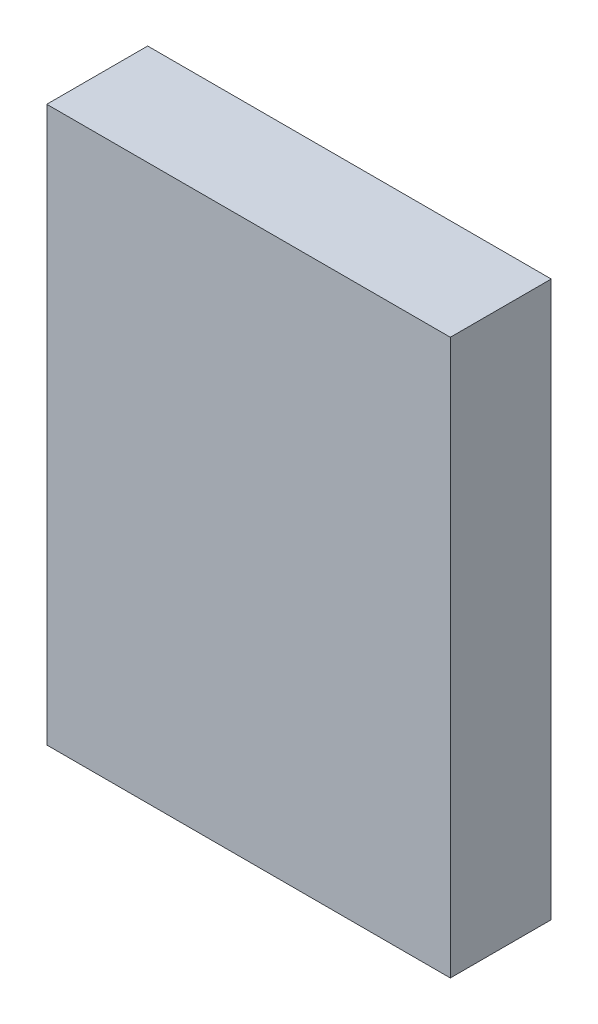
ISO-10303-21;
HEADER;
FILE_DESCRIPTION(('STEP AP214'),'2;1');
FILE_NAME('part.step','',(''),(''),'','','');
FILE_SCHEMA(('AUTOMOTIVE_DESIGN { 1 0 10303 214 1 1 1 1 }'));
ENDSEC;
DATA;
#1=APPLICATION_CONTEXT('core data for automotive mechanical design processes');
#2=APPLICATION_PROTOCOL_DEFINITION('international standard','automotive_design',2000,#1);
#3=PRODUCT_CONTEXT('',#1,'mechanical');
#4=PRODUCT('Part','Part','',(#3));
#5=PRODUCT_RELATED_PRODUCT_CATEGORY('part','',(#4));
#6=PRODUCT_DEFINITION_FORMATION('','',#4);
#7=PRODUCT_DEFINITION_CONTEXT('part definition',#1,'design');
#8=PRODUCT_DEFINITION('design','',#6,#7);
#9=PRODUCT_DEFINITION_SHAPE('','',#8);
#10=(LENGTH_UNIT() NAMED_UNIT(*) SI_UNIT(.MILLI.,.METRE.));
#11=(NAMED_UNIT(*) PLANE_ANGLE_UNIT() SI_UNIT($,.RADIAN.));
#12=(NAMED_UNIT(*) SI_UNIT($,.STERADIAN.) SOLID_ANGLE_UNIT());
#13=UNCERTAINTY_MEASURE_WITH_UNIT(LENGTH_MEASURE(1.E-05),#10,'distance_accuracy_value','');
#14=(GEOMETRIC_REPRESENTATION_CONTEXT(3) GLOBAL_UNCERTAINTY_ASSIGNED_CONTEXT((#13)) GLOBAL_UNIT_ASSIGNED_CONTEXT((#10,
#11,#12)) REPRESENTATION_CONTEXT('',''));
#15=CARTESIAN_POINT('',(0.,0.,0.));
#16=DIRECTION('',(0.,0.,1.));
#17=DIRECTION('',(1.,0.,0.));
#18=AXIS2_PLACEMENT_3D('',#15,#16,#17);
#19=CARTESIAN_POINT('',(-10.,-13.75,5.));
#20=DIRECTION('',(1.,0.,0.));
#21=DIRECTION('',(0.,0.,-1.));
#22=AXIS2_PLACEMENT_3D('',#19,#20,#21);
#23=PLANE('',#22);
#24=DIRECTION('',(0.,-1.,0.));
#25=VECTOR('',#24,1.);
#26=CARTESIAN_POINT('',(-10.,-13.75,0.));
#27=LINE('',#26,#25);
#28=CARTESIAN_POINT('',(-10.,13.75,0.));
#29=VERTEX_POINT('',#28);
#30=CARTESIAN_POINT('',(-10.,-13.75,0.));
#31=VERTEX_POINT('',#30);
#32=EDGE_CURVE('E95',#29,#31,#27,.T.);
#33=ORIENTED_EDGE('',*,*,#32,.T.);
#34=DIRECTION('',(0.,0.,-1.));
#35=VECTOR('',#34,1.);
#36=CARTESIAN_POINT('',(-10.,-13.75,5.));
#37=LINE('',#36,#35);
#38=CARTESIAN_POINT('',(-10.,-13.75,5.));
#39=VERTEX_POINT('',#38);
#40=EDGE_CURVE('E11',#39,#31,#37,.T.);
#41=ORIENTED_EDGE('',*,*,#40,.F.);
#42=DIRECTION('',(0.,-1.,0.));
#43=VECTOR('',#42,1.);
#44=CARTESIAN_POINT('',(-10.,-13.75,5.));
#45=LINE('',#44,#43);
#46=CARTESIAN_POINT('',(-10.,13.75,5.));
#47=VERTEX_POINT('',#46);
#48=EDGE_CURVE('E83',#47,#39,#45,.T.);
#49=ORIENTED_EDGE('',*,*,#48,.F.);
#50=DIRECTION('',(0.,0.,-1.));
#51=VECTOR('',#50,1.);
#52=CARTESIAN_POINT('',(-10.,13.75,5.));
#53=LINE('',#52,#51);
#54=EDGE_CURVE('E91',#47,#29,#53,.T.);
#55=ORIENTED_EDGE('',*,*,#54,.T.);
#56=EDGE_LOOP('',(#33,#41,#49,#55));
#57=FACE_BOUND('',#56,.T.);
#58=ADVANCED_FACE('F32',(#57),#23,.F.);
#59=CARTESIAN_POINT('',(-10.,-13.75,5.));
#60=DIRECTION('',(0.,1.,0.));
#61=DIRECTION('',(0.,0.,1.));
#62=AXIS2_PLACEMENT_3D('',#59,#60,#61);
#63=PLANE('',#62);
#64=DIRECTION('',(1.,0.,0.));
#65=VECTOR('',#64,1.);
#66=CARTESIAN_POINT('',(-10.,-13.75,0.));
#67=LINE('',#66,#65);
#68=CARTESIAN_POINT('',(10.,-13.75,0.));
#69=VERTEX_POINT('',#68);
#70=EDGE_CURVE('E87',#31,#69,#67,.T.);
#71=ORIENTED_EDGE('',*,*,#70,.T.);
#72=DIRECTION('',(0.,0.,-1.));
#73=VECTOR('',#72,1.);
#74=CARTESIAN_POINT('',(10.,-13.75,5.));
#75=LINE('',#74,#73);
#76=CARTESIAN_POINT('',(10.,-13.75,5.));
#77=VERTEX_POINT('',#76);
#78=EDGE_CURVE('E40',#77,#69,#75,.T.);
#79=ORIENTED_EDGE('',*,*,#78,.F.);
#80=DIRECTION('',(1.,0.,0.));
#81=VECTOR('',#80,1.);
#82=CARTESIAN_POINT('',(-10.,-13.75,5.));
#83=LINE('',#82,#81);
#84=EDGE_CURVE('E78',#39,#77,#83,.T.);
#85=ORIENTED_EDGE('',*,*,#84,.F.);
#86=ORIENTED_EDGE('',*,*,#40,.T.);
#87=EDGE_LOOP('',(#71,#79,#85,#86));
#88=FACE_BOUND('',#87,.T.);
#89=ADVANCED_FACE('F86',(#88),#63,.F.);
#90=CARTESIAN_POINT('',(10.,-13.75,5.));
#91=DIRECTION('',(-1.,0.,0.));
#92=DIRECTION('',(0.,0.,1.));
#93=AXIS2_PLACEMENT_3D('',#90,#91,#92);
#94=PLANE('',#93);
#95=DIRECTION('',(0.,1.,0.));
#96=VECTOR('',#95,1.);
#97=CARTESIAN_POINT('',(10.,-13.75,0.));
#98=LINE('',#97,#96);
#99=CARTESIAN_POINT('',(10.,13.75,0.));
#100=VERTEX_POINT('',#99);
#101=EDGE_CURVE('E65',#69,#100,#98,.T.);
#102=ORIENTED_EDGE('',*,*,#101,.T.);
#103=DIRECTION('',(0.,0.,-1.));
#104=VECTOR('',#103,1.);
#105=CARTESIAN_POINT('',(10.,13.75,5.));
#106=LINE('',#105,#104);
#107=CARTESIAN_POINT('',(10.,13.75,5.));
#108=VERTEX_POINT('',#107);
#109=EDGE_CURVE('E88',#108,#100,#106,.T.);
#110=ORIENTED_EDGE('',*,*,#109,.F.);
#111=DIRECTION('',(0.,1.,0.));
#112=VECTOR('',#111,1.);
#113=CARTESIAN_POINT('',(10.,-13.75,5.));
#114=LINE('',#113,#112);
#115=EDGE_CURVE('E81',#77,#108,#114,.T.);
#116=ORIENTED_EDGE('',*,*,#115,.F.);
#117=ORIENTED_EDGE('',*,*,#78,.T.);
#118=EDGE_LOOP('',(#102,#110,#116,#117));
#119=FACE_BOUND('',#118,.T.);
#120=ADVANCED_FACE('F89',(#119),#94,.F.);
#121=CARTESIAN_POINT('',(-10.,13.75,5.));
#122=DIRECTION('',(0.,-1.,0.));
#123=DIRECTION('',(0.,0.,-1.));
#124=AXIS2_PLACEMENT_3D('',#121,#122,#123);
#125=PLANE('',#124);
#126=DIRECTION('',(-1.,0.,0.));
#127=VECTOR('',#126,1.);
#128=CARTESIAN_POINT('',(-10.,13.75,0.));
#129=LINE('',#128,#127);
#130=EDGE_CURVE('E71',#100,#29,#129,.T.);
#131=ORIENTED_EDGE('',*,*,#130,.T.);
#132=ORIENTED_EDGE('',*,*,#54,.F.);
#133=DIRECTION('',(-1.,0.,0.));
#134=VECTOR('',#133,1.);
#135=CARTESIAN_POINT('',(-10.,13.75,5.));
#136=LINE('',#135,#134);
#137=EDGE_CURVE('E48',#108,#47,#136,.T.);
#138=ORIENTED_EDGE('',*,*,#137,.F.);
#139=ORIENTED_EDGE('',*,*,#109,.T.);
#140=EDGE_LOOP('',(#131,#132,#138,#139));
#141=FACE_BOUND('',#140,.T.);
#142=ADVANCED_FACE('F102',(#141),#125,.F.);
#143=CARTESIAN_POINT('',(0.,0.,5.));
#144=DIRECTION('',(0.,0.,-1.));
#145=DIRECTION('',(-1.,0.,0.));
#146=AXIS2_PLACEMENT_3D('',#143,#144,#145);
#147=PLANE('',#146);
#148=ORIENTED_EDGE('',*,*,#48,.T.);
#149=ORIENTED_EDGE('',*,*,#84,.T.);
#150=ORIENTED_EDGE('',*,*,#115,.T.);
#151=ORIENTED_EDGE('',*,*,#137,.T.);
#152=EDGE_LOOP('',(#148,#149,#150,#151));
#153=FACE_BOUND('',#152,.T.);
#154=ADVANCED_FACE('F79',(#153),#147,.F.);
#155=CARTESIAN_POINT('',(0.,0.,0.));
#156=DIRECTION('',(0.,0.,-1.));
#157=DIRECTION('',(-1.,0.,0.));
#158=AXIS2_PLACEMENT_3D('',#155,#156,#157);
#159=PLANE('',#158);
#160=ORIENTED_EDGE('',*,*,#32,.F.);
#161=ORIENTED_EDGE('',*,*,#130,.F.);
#162=ORIENTED_EDGE('',*,*,#101,.F.);
#163=ORIENTED_EDGE('',*,*,#70,.F.);
#164=EDGE_LOOP('',(#160,#161,#162,#163));
#165=FACE_BOUND('',#164,.T.);
#166=ADVANCED_FACE('F105',(#165),#159,.T.);
#167=CLOSED_SHELL('',(#58,#89,#120,#142,#154,#166));
#168=MANIFOLD_SOLID_BREP('B2',#167);
#169=ADVANCED_BREP_SHAPE_REPRESENTATION('',(#18,#168),#14);
#170=SHAPE_DEFINITION_REPRESENTATION(#9,#169);
ENDSEC;
END-ISO-10303-21;
